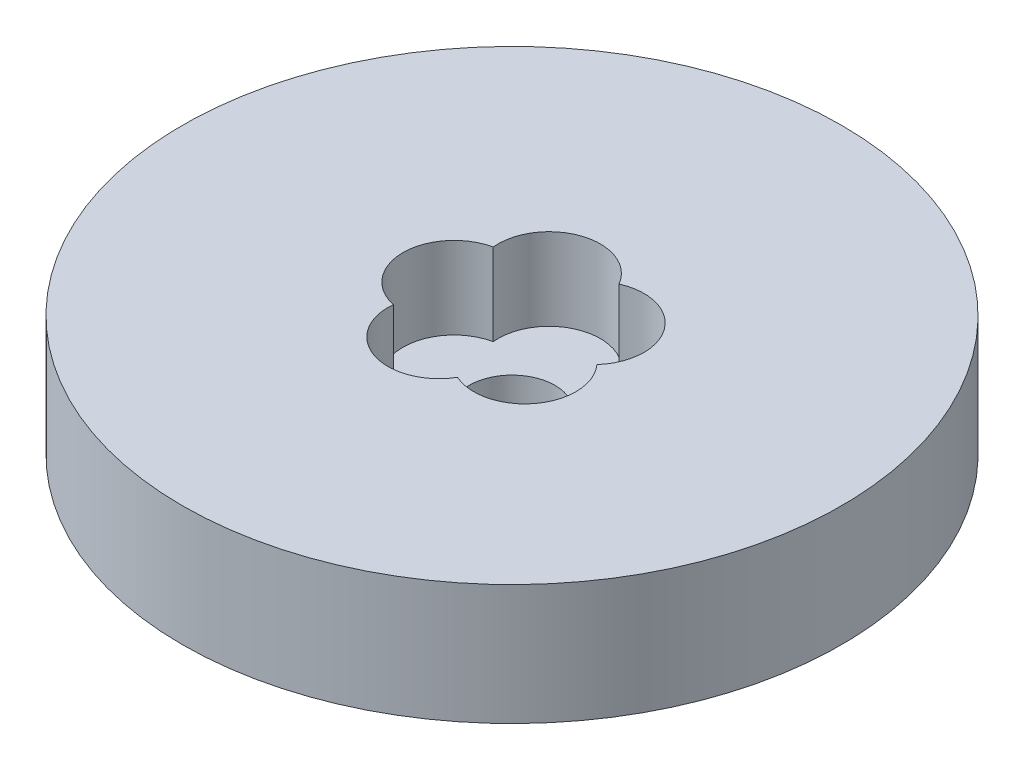
ISO-10303-21;
HEADER;
FILE_DESCRIPTION(('STEP AP214'),'2;1');
FILE_NAME('part.step','',(''),(''),'','','');
FILE_SCHEMA(('AUTOMOTIVE_DESIGN { 1 0 10303 214 1 1 1 1 }'));
ENDSEC;
DATA;
#1=APPLICATION_CONTEXT('core data for automotive mechanical design processes');
#2=APPLICATION_PROTOCOL_DEFINITION('international standard','automotive_design',2000,#1);
#3=PRODUCT_CONTEXT('',#1,'mechanical');
#4=PRODUCT('Part','Part','',(#3));
#5=PRODUCT_RELATED_PRODUCT_CATEGORY('part','',(#4));
#6=PRODUCT_DEFINITION_FORMATION('','',#4);
#7=PRODUCT_DEFINITION_CONTEXT('part definition',#1,'design');
#8=PRODUCT_DEFINITION('design','',#6,#7);
#9=PRODUCT_DEFINITION_SHAPE('','',#8);
#10=(LENGTH_UNIT() NAMED_UNIT(*) SI_UNIT(.MILLI.,.METRE.));
#11=(NAMED_UNIT(*) PLANE_ANGLE_UNIT() SI_UNIT($,.RADIAN.));
#12=(NAMED_UNIT(*) SI_UNIT($,.STERADIAN.) SOLID_ANGLE_UNIT());
#13=UNCERTAINTY_MEASURE_WITH_UNIT(LENGTH_MEASURE(1.E-05),#10,'distance_accuracy_value','');
#14=(GEOMETRIC_REPRESENTATION_CONTEXT(3) GLOBAL_UNCERTAINTY_ASSIGNED_CONTEXT((#13)) GLOBAL_UNIT_ASSIGNED_CONTEXT((#10,
#11,#12)) REPRESENTATION_CONTEXT('',''));
#15=CARTESIAN_POINT('',(0.,0.,0.));
#16=DIRECTION('',(0.,0.,1.));
#17=DIRECTION('',(1.,0.,0.));
#18=AXIS2_PLACEMENT_3D('',#15,#16,#17);
#19=CARTESIAN_POINT('',(0.,21.,0.));
#20=DIRECTION('',(0.,-1.,0.));
#21=DIRECTION('',(0.,0.,-1.));
#22=AXIS2_PLACEMENT_3D('',#19,#20,#21);
#23=CYLINDRICAL_SURFACE('',#22,7.5);
#24=CARTESIAN_POINT('',(0.,0.,0.));
#25=DIRECTION('',(0.,1.,0.));
#26=DIRECTION('',(0.,0.,1.));
#27=AXIS2_PLACEMENT_3D('',#24,#25,#26);
#28=CIRCLE('',#27,7.5);
#29=CARTESIAN_POINT('',(0.,0.,-7.5));
#30=VERTEX_POINT('',#29);
#31=EDGE_CURVE('E129',#30,#30,#28,.T.);
#32=CARTESIAN_POINT('',(0.,6.69996960669796,0.));
#33=DIRECTION('',(0.,1.,0.));
#34=DIRECTION('',(0.,0.,1.));
#35=AXIS2_PLACEMENT_3D('',#32,#33,#34);
#36=CIRCLE('',#35,7.5);
#37=CARTESIAN_POINT('',(0.,6.69996960669796,-7.5));
#38=VERTEX_POINT('',#37);
#39=EDGE_CURVE('E11',#38,#38,#36,.T.);
#40=CARTESIAN_POINT('',(0.,0.,-7.5));
#41=CARTESIAN_POINT('',(0.,0.0697913500697702,-7.5));
#42=CARTESIAN_POINT('',(0.,0.13958270013954,-7.5));
#43=CARTESIAN_POINT('',(0.,0.279165400279081,-7.5));
#44=CARTESIAN_POINT('',(0.,0.348956750348851,-7.5));
#45=CARTESIAN_POINT('',(0.,0.488539450488393,-7.5));
#46=CARTESIAN_POINT('',(0.,0.558330800558164,-7.5));
#47=CARTESIAN_POINT('',(0.,0.697913500697706,-7.5));
#48=CARTESIAN_POINT('',(0.,0.767704850767476,-7.5));
#49=CARTESIAN_POINT('',(0.,0.907287550907016,-7.5));
#50=CARTESIAN_POINT('',(0.,0.977078900976787,-7.5));
#51=CARTESIAN_POINT('',(0.,1.11666160111633,-7.5));
#52=CARTESIAN_POINT('',(0.,1.1864529511861,-7.5));
#53=CARTESIAN_POINT('',(0.,1.32603565132564,-7.5));
#54=CARTESIAN_POINT('',(0.,1.39582700139541,-7.5));
#55=CARTESIAN_POINT('',(0.,1.53540970153495,-7.5));
#56=CARTESIAN_POINT('',(0.,1.60520105160472,-7.5));
#57=CARTESIAN_POINT('',(0.,1.74478375174426,-7.5));
#58=CARTESIAN_POINT('',(0.,1.81457510181403,-7.5));
#59=CARTESIAN_POINT('',(0.,1.95415780195357,-7.5));
#60=CARTESIAN_POINT('',(0.,2.02394915202334,-7.5));
#61=CARTESIAN_POINT('',(0.,2.16353185216288,-7.5));
#62=CARTESIAN_POINT('',(0.,2.23332320223265,-7.5));
#63=CARTESIAN_POINT('',(0.,2.3729059023722,-7.5));
#64=CARTESIAN_POINT('',(0.,2.44269725244197,-7.5));
#65=CARTESIAN_POINT('',(0.,2.58227995258151,-7.5));
#66=CARTESIAN_POINT('',(0.,2.65207130265128,-7.5));
#67=CARTESIAN_POINT('',(0.,2.79165400279082,-7.5));
#68=CARTESIAN_POINT('',(0.,2.86144535286059,-7.5));
#69=CARTESIAN_POINT('',(0.,3.00102805300013,-7.5));
#70=CARTESIAN_POINT('',(0.,3.0708194030699,-7.5));
#71=CARTESIAN_POINT('',(0.,3.21040210320944,-7.5));
#72=CARTESIAN_POINT('',(0.,3.28019345327921,-7.5));
#73=CARTESIAN_POINT('',(0.,3.41977615341875,-7.5));
#74=CARTESIAN_POINT('',(0.,3.48956750348853,-7.5));
#75=CARTESIAN_POINT('',(0.,3.62915020362807,-7.5));
#76=CARTESIAN_POINT('',(0.,3.69894155369784,-7.5));
#77=CARTESIAN_POINT('',(0.,3.83852425383738,-7.5));
#78=CARTESIAN_POINT('',(0.,3.90831560390715,-7.5));
#79=CARTESIAN_POINT('',(0.,4.04789830404669,-7.5));
#80=CARTESIAN_POINT('',(0.,4.11768965411646,-7.5));
#81=CARTESIAN_POINT('',(0.,4.257272354256,-7.5));
#82=CARTESIAN_POINT('',(0.,4.32706370432577,-7.5));
#83=CARTESIAN_POINT('',(0.,4.46664640446531,-7.5));
#84=CARTESIAN_POINT('',(0.,4.53643775453508,-7.5));
#85=CARTESIAN_POINT('',(0.,4.67602045467462,-7.5));
#86=CARTESIAN_POINT('',(0.,4.74581180474439,-7.5));
#87=CARTESIAN_POINT('',(0.,4.88539450488393,-7.5));
#88=CARTESIAN_POINT('',(0.,4.9551858549537,-7.5));
#89=CARTESIAN_POINT('',(0.,5.09476855509324,-7.5));
#90=CARTESIAN_POINT('',(0.,5.16455990516301,-7.5));
#91=CARTESIAN_POINT('',(0.,5.30414260530256,-7.5));
#92=CARTESIAN_POINT('',(0.,5.37393395537233,-7.5));
#93=CARTESIAN_POINT('',(0.,5.51351665551187,-7.5));
#94=CARTESIAN_POINT('',(0.,5.58330800558164,-7.5));
#95=CARTESIAN_POINT('',(0.,5.72289070572118,-7.5));
#96=CARTESIAN_POINT('',(0.,5.79268205579095,-7.5));
#97=CARTESIAN_POINT('',(0.,5.93226475593049,-7.5));
#98=CARTESIAN_POINT('',(0.,6.00205610600026,-7.5));
#99=CARTESIAN_POINT('',(0.,6.1416388061398,-7.5));
#100=CARTESIAN_POINT('',(0.,6.21143015620957,-7.5));
#101=CARTESIAN_POINT('',(0.,6.35101285634911,-7.5));
#102=CARTESIAN_POINT('',(0.,6.42080420641888,-7.5));
#103=CARTESIAN_POINT('',(0.,6.56038690655842,-7.5));
#104=CARTESIAN_POINT('',(0.,6.63017825662819,-7.5));
#105=CARTESIAN_POINT('',(0.,6.69996960669796,-7.5));
#106=B_SPLINE_CURVE_WITH_KNOTS('',3,(#40,#41,#42,#43,#44,#45,#46,#47,#48,#49,#50,#51,#52,#53,
#54,#55,#56,#57,#58,#59,#60,#61,#62,#63,#64,#65,#66,#67,#68,#69,#70,#71,#72,#73,#74,#75,#76,#77,
#78,#79,#80,#81,#82,#83,#84,#85,#86,#87,#88,#89,#90,#91,#92,#93,#94,#95,#96,#97,#98,#99,#100,
#101,#102,#103,#104,#105),.UNSPECIFIED.,.F.,.F.,(4,2,2,2,2,2,2,2,2,2,2,2,2,2,2,2,2,2,2,2,2,2,2,
2,2,2,2,2,2,2,2,2,4),(0.,0.209374050209311,0.418748100418621,0.628122150627936,
0.837496200837246,1.04687025104656,1.25624430125587,1.46561835146518,1.67499240167449,
1.8843664518838,2.09374050209311,2.30311455230242,2.51248860251174,2.72186265272105,
2.93123670293036,3.14061075313967,3.34998480334898,3.5593588535583,3.76873290376761,
3.97810695397692,4.18748100418623,4.39685505439554,4.60622910460485,4.81560315481416,
5.02497720502347,5.23435125523278,5.4437253054421,5.65309935565141,5.86247340586072,
6.07184745607003,6.28122150627934,6.49059555648865,6.69996960669796),.UNSPECIFIED.);
#107=EDGE_CURVE('BSEAM39',#30,#38,#106,.T.);
#108=ORIENTED_EDGE('',*,*,#31,.F.);
#109=ORIENTED_EDGE('',*,*,#39,.T.);
#110=ORIENTED_EDGE('',*,*,#107,.T.);
#111=ORIENTED_EDGE('',*,*,#107,.F.);
#112=EDGE_LOOP('',(#108,#110,#109,#111));
#113=FACE_BOUND('',#112,.T.);
#114=ADVANCED_FACE('F39',(#113),#23,.F.);
#115=CARTESIAN_POINT('',(0.,21.,0.));
#116=DIRECTION('',(0.,-1.,0.));
#117=DIRECTION('',(0.,0.,-1.));
#118=AXIS2_PLACEMENT_3D('',#115,#116,#117);
#119=CYLINDRICAL_SURFACE('',#118,57.5);
#120=CARTESIAN_POINT('',(0.,21.,0.));
#121=DIRECTION('',(0.,1.,0.));
#122=DIRECTION('',(0.,0.,1.));
#123=AXIS2_PLACEMENT_3D('',#120,#121,#122);
#124=CIRCLE('',#123,57.5);
#125=CARTESIAN_POINT('',(0.,21.,-57.5));
#126=VERTEX_POINT('',#125);
#127=EDGE_CURVE('E50',#126,#126,#124,.T.);
#128=CARTESIAN_POINT('',(0.,0.,0.));
#129=DIRECTION('',(0.,1.,0.));
#130=DIRECTION('',(0.,0.,1.));
#131=AXIS2_PLACEMENT_3D('',#128,#129,#130);
#132=CIRCLE('',#131,57.5);
#133=CARTESIAN_POINT('',(0.,0.,-57.5));
#134=VERTEX_POINT('',#133);
#135=EDGE_CURVE('E133',#134,#134,#132,.T.);
#136=CARTESIAN_POINT('',(0.,21.,-57.5));
#137=CARTESIAN_POINT('',(0.,20.78125,-57.5));
#138=CARTESIAN_POINT('',(0.,20.5625,-57.5));
#139=CARTESIAN_POINT('',(0.,20.125,-57.5));
#140=CARTESIAN_POINT('',(0.,19.90625,-57.5));
#141=CARTESIAN_POINT('',(0.,19.46875,-57.5));
#142=CARTESIAN_POINT('',(0.,19.25,-57.5));
#143=CARTESIAN_POINT('',(0.,18.8125,-57.5));
#144=CARTESIAN_POINT('',(0.,18.59375,-57.5));
#145=CARTESIAN_POINT('',(0.,18.15625,-57.5));
#146=CARTESIAN_POINT('',(0.,17.9375,-57.5));
#147=CARTESIAN_POINT('',(0.,17.5,-57.5));
#148=CARTESIAN_POINT('',(0.,17.28125,-57.5));
#149=CARTESIAN_POINT('',(0.,16.84375,-57.5));
#150=CARTESIAN_POINT('',(0.,16.625,-57.5));
#151=CARTESIAN_POINT('',(0.,16.1875,-57.5));
#152=CARTESIAN_POINT('',(0.,15.96875,-57.5));
#153=CARTESIAN_POINT('',(0.,15.53125,-57.5));
#154=CARTESIAN_POINT('',(0.,15.3125,-57.5));
#155=CARTESIAN_POINT('',(0.,14.875,-57.5));
#156=CARTESIAN_POINT('',(0.,14.65625,-57.5));
#157=CARTESIAN_POINT('',(0.,14.21875,-57.5));
#158=CARTESIAN_POINT('',(0.,14.,-57.5));
#159=CARTESIAN_POINT('',(0.,13.5625,-57.5));
#160=CARTESIAN_POINT('',(0.,13.34375,-57.5));
#161=CARTESIAN_POINT('',(0.,12.90625,-57.5));
#162=CARTESIAN_POINT('',(0.,12.6875,-57.5));
#163=CARTESIAN_POINT('',(0.,12.25,-57.5));
#164=CARTESIAN_POINT('',(0.,12.03125,-57.5));
#165=CARTESIAN_POINT('',(0.,11.59375,-57.5));
#166=CARTESIAN_POINT('',(0.,11.375,-57.5));
#167=CARTESIAN_POINT('',(0.,10.9375,-57.5));
#168=CARTESIAN_POINT('',(0.,10.71875,-57.5));
#169=CARTESIAN_POINT('',(0.,10.28125,-57.5));
#170=CARTESIAN_POINT('',(0.,10.0625,-57.5));
#171=CARTESIAN_POINT('',(0.,9.625,-57.5));
#172=CARTESIAN_POINT('',(0.,9.40625,-57.5));
#173=CARTESIAN_POINT('',(0.,8.96875,-57.5));
#174=CARTESIAN_POINT('',(0.,8.75,-57.5));
#175=CARTESIAN_POINT('',(0.,8.3125,-57.5));
#176=CARTESIAN_POINT('',(0.,8.09375,-57.5));
#177=CARTESIAN_POINT('',(0.,7.65625,-57.5));
#178=CARTESIAN_POINT('',(0.,7.4375,-57.5));
#179=CARTESIAN_POINT('',(0.,7.,-57.5));
#180=CARTESIAN_POINT('',(0.,6.78125,-57.5));
#181=CARTESIAN_POINT('',(0.,6.34375,-57.5));
#182=CARTESIAN_POINT('',(0.,6.125,-57.5));
#183=CARTESIAN_POINT('',(0.,5.6875,-57.5));
#184=CARTESIAN_POINT('',(0.,5.46875,-57.5));
#185=CARTESIAN_POINT('',(0.,5.03125,-57.5));
#186=CARTESIAN_POINT('',(0.,4.8125,-57.5));
#187=CARTESIAN_POINT('',(0.,4.375,-57.5));
#188=CARTESIAN_POINT('',(0.,4.15625,-57.5));
#189=CARTESIAN_POINT('',(0.,3.71875,-57.5));
#190=CARTESIAN_POINT('',(0.,3.5,-57.5));
#191=CARTESIAN_POINT('',(0.,3.0625,-57.5));
#192=CARTESIAN_POINT('',(0.,2.84375,-57.5));
#193=CARTESIAN_POINT('',(0.,2.40625,-57.5));
#194=CARTESIAN_POINT('',(0.,2.1875,-57.5));
#195=CARTESIAN_POINT('',(0.,1.75,-57.5));
#196=CARTESIAN_POINT('',(0.,1.53125,-57.5));
#197=CARTESIAN_POINT('',(0.,1.09375,-57.5));
#198=CARTESIAN_POINT('',(0.,0.875000000000001,-57.5));
#199=CARTESIAN_POINT('',(0.,0.4375,-57.5));
#200=CARTESIAN_POINT('',(0.,0.21875,-57.5));
#201=CARTESIAN_POINT('',(0.,0.,-57.5));
#202=B_SPLINE_CURVE_WITH_KNOTS('',3,(#136,#137,#138,#139,#140,#141,#142,#143,#144,#145,#146,
#147,#148,#149,#150,#151,#152,#153,#154,#155,#156,#157,#158,#159,#160,#161,#162,#163,#164,#165,
#166,#167,#168,#169,#170,#171,#172,#173,#174,#175,#176,#177,#178,#179,#180,#181,#182,#183,#184,
#185,#186,#187,#188,#189,#190,#191,#192,#193,#194,#195,#196,#197,#198,#199,#200,#201),
.UNSPECIFIED.,.F.,.F.,(4,2,2,2,2,2,2,2,2,2,2,2,2,2,2,2,2,2,2,2,2,2,2,2,2,2,2,2,2,2,2,2,4),(0.,
0.656250000000001,1.3125,1.96875,2.625,3.28125,3.9375,4.59375,5.25,5.90625,6.5625,7.21875,7.875,
8.53125,9.1875,9.84375,10.5,11.15625,11.8125,12.46875,13.125,13.78125,14.4375,15.09375,15.75,
16.40625,17.0625,17.71875,18.375,19.03125,19.6875,20.34375,21.),.UNSPECIFIED.);
#203=EDGE_CURVE('BSEAM41',#126,#134,#202,.T.);
#204=ORIENTED_EDGE('',*,*,#127,.F.);
#205=ORIENTED_EDGE('',*,*,#135,.T.);
#206=ORIENTED_EDGE('',*,*,#203,.T.);
#207=ORIENTED_EDGE('',*,*,#203,.F.);
#208=EDGE_LOOP('',(#204,#206,#205,#207));
#209=FACE_BOUND('',#208,.T.);
#210=ADVANCED_FACE('F41',(#209),#119,.T.);
#211=CARTESIAN_POINT('',(0.,21.,0.));
#212=DIRECTION('',(0.,1.,0.));
#213=DIRECTION('',(0.,0.,1.));
#214=AXIS2_PLACEMENT_3D('',#211,#212,#213);
#215=PLANE('',#214);
#216=CARTESIAN_POINT('',(-3.12386026699774,21.,9.61425331617492));
#217=DIRECTION('',(0.,1.,0.));
#218=DIRECTION('',(0.951056516295155,0.,0.309016994374945));
#219=AXIS2_PLACEMENT_3D('',#216,#217,#218);
#220=CIRCLE('',#219,8.91402800557836);
#221=CARTESIAN_POINT('',(-11.9921942566491,21.,8.71283913155722));
#222=VERTEX_POINT('',#221);
#223=CARTESIAN_POINT('',(4.58061060634873,21.,14.0976698533696));
#224=VERTEX_POINT('',#223);
#225=EDGE_CURVE('E119',#222,#224,#220,.T.);
#226=ORIENTED_EDGE('',*,*,#225,.F.);
#227=CARTESIAN_POINT('',(-10.1090241762154,21.,0.));
#228=DIRECTION('',(0.,1.,0.));
#229=DIRECTION('',(0.,0.,1.));
#230=AXIS2_PLACEMENT_3D('',#227,#228,#229);
#231=CIRCLE('',#230,8.91402800557836);
#232=CARTESIAN_POINT('',(-11.9921942566492,21.,-8.71283913155719));
#233=VERTEX_POINT('',#232);
#234=EDGE_CURVE('E127',#233,#222,#231,.T.);
#235=ORIENTED_EDGE('',*,*,#234,.F.);
#236=CARTESIAN_POINT('',(-3.12386026699787,21.,-9.61425331617487));
#237=DIRECTION('',(0.,1.,0.));
#238=DIRECTION('',(-0.95105651629515,0.,0.309016994374958));
#239=AXIS2_PLACEMENT_3D('',#236,#237,#238);
#240=CIRCLE('',#239,8.91402800557836);
#241=CARTESIAN_POINT('',(4.58061060634853,21.,-14.0976698533697));
#242=VERTEX_POINT('',#241);
#243=EDGE_CURVE('E53',#242,#233,#240,.T.);
#244=ORIENTED_EDGE('',*,*,#243,.F.);
#245=CARTESIAN_POINT('',(8.17837235510541,21.,-5.94193532584755));
#246=DIRECTION('',(0.,1.,0.));
#247=DIRECTION('',(-0.58778525229248,0.,-0.809016994374942));
#248=AXIS2_PLACEMENT_3D('',#245,#246,#247);
#249=CIRCLE('',#248,8.91402800557836);
#250=CARTESIAN_POINT('',(14.8231673006008,21.,-1.06685493772574E-13));
#251=VERTEX_POINT('',#250);
#252=EDGE_CURVE('E99',#251,#242,#249,.T.);
#253=ORIENTED_EDGE('',*,*,#252,.F.);
#254=CARTESIAN_POINT('',(8.1783723551055,21.,5.94193532584744));
#255=DIRECTION('',(0.,1.,0.));
#256=DIRECTION('',(0.587785252292469,0.,-0.809016994374951));
#257=AXIS2_PLACEMENT_3D('',#254,#255,#256);
#258=CIRCLE('',#257,8.91402800557836);
#259=EDGE_CURVE('E113',#224,#251,#258,.T.);
#260=ORIENTED_EDGE('',*,*,#259,.F.);
#261=EDGE_LOOP('',(#226,#235,#244,#253,#260));
#262=FACE_BOUND('',#261,.T.);
#263=ORIENTED_EDGE('',*,*,#127,.T.);
#264=EDGE_LOOP('',(#263));
#265=FACE_BOUND('',#264,.T.);
#266=ADVANCED_FACE('F141',(#262,#265),#215,.T.);
#267=CARTESIAN_POINT('',(0.,0.,0.));
#268=DIRECTION('',(0.,1.,0.));
#269=DIRECTION('',(0.,0.,1.));
#270=AXIS2_PLACEMENT_3D('',#267,#268,#269);
#271=PLANE('',#270);
#272=ORIENTED_EDGE('',*,*,#31,.T.);
#273=EDGE_LOOP('',(#272));
#274=FACE_BOUND('',#273,.T.);
#275=ORIENTED_EDGE('',*,*,#135,.F.);
#276=EDGE_LOOP('',(#275));
#277=FACE_BOUND('',#276,.T.);
#278=ADVANCED_FACE('F139',(#274,#277),#271,.F.);
#279=CARTESIAN_POINT('',(-10.1090241762154,6.69996960669796,0.));
#280=DIRECTION('',(0.,1.,0.));
#281=DIRECTION('',(0.,0.,1.));
#282=AXIS2_PLACEMENT_3D('',#279,#280,#281);
#283=CYLINDRICAL_SURFACE('',#282,8.91402800557836);
#284=ORIENTED_EDGE('',*,*,#234,.T.);
#285=DIRECTION('',(0.,1.,0.));
#286=VECTOR('',#285,1.);
#287=CARTESIAN_POINT('',(-11.9921942566491,13.849984803349,8.71283913155721));
#288=LINE('',#287,#286);
#289=CARTESIAN_POINT('',(-11.9921942566491,6.69996960669796,8.71283913155721));
#290=VERTEX_POINT('',#289);
#291=EDGE_CURVE('E65',#222,#290,#288,.F.);
#292=ORIENTED_EDGE('',*,*,#291,.T.);
#293=CARTESIAN_POINT('',(-10.1090241762154,6.69996960669796,0.));
#294=DIRECTION('',(0.,1.,0.));
#295=DIRECTION('',(0.,0.,1.));
#296=AXIS2_PLACEMENT_3D('',#293,#294,#295);
#297=CIRCLE('',#296,8.91402800557836);
#298=CARTESIAN_POINT('',(-11.9921942566492,6.69996960669796,-8.71283913155719));
#299=VERTEX_POINT('',#298);
#300=EDGE_CURVE('E130',#299,#290,#297,.T.);
#301=ORIENTED_EDGE('',*,*,#300,.F.);
#302=DIRECTION('',(0.,1.,0.));
#303=VECTOR('',#302,1.);
#304=CARTESIAN_POINT('',(-11.9921942566492,13.849984803349,-8.71283913155719));
#305=LINE('',#304,#303);
#306=EDGE_CURVE('E108',#299,#233,#305,.T.);
#307=ORIENTED_EDGE('',*,*,#306,.T.);
#308=EDGE_LOOP('',(#284,#292,#301,#307));
#309=FACE_BOUND('',#308,.T.);
#310=ADVANCED_FACE('F142',(#309),#283,.F.);
#311=CARTESIAN_POINT('',(-10.1090241762154,6.69996960669796,0.));
#312=DIRECTION('',(0.,1.,0.));
#313=DIRECTION('',(0.,0.,1.));
#314=AXIS2_PLACEMENT_3D('',#311,#312,#313);
#315=PLANE('',#314);
#316=ORIENTED_EDGE('',*,*,#300,.T.);
#317=CARTESIAN_POINT('',(-3.12386026699774,6.69996960669796,9.61425331617492));
#318=DIRECTION('',(0.,1.,0.));
#319=DIRECTION('',(0.951056516295155,0.,0.309016994374945));
#320=AXIS2_PLACEMENT_3D('',#317,#318,#319);
#321=CIRCLE('',#320,8.91402800557836);
#322=CARTESIAN_POINT('',(4.58061060634873,6.69996960669796,14.0976698533696));
#323=VERTEX_POINT('',#322);
#324=EDGE_CURVE('E121',#290,#323,#321,.T.);
#325=ORIENTED_EDGE('',*,*,#324,.T.);
#326=CARTESIAN_POINT('',(8.1783723551055,6.69996960669796,5.94193532584744));
#327=DIRECTION('',(0.,1.,0.));
#328=DIRECTION('',(0.587785252292469,0.,-0.809016994374951));
#329=AXIS2_PLACEMENT_3D('',#326,#327,#328);
#330=CIRCLE('',#329,8.91402800557836);
#331=CARTESIAN_POINT('',(14.8231673006008,6.69996960669796,-1.06685493772574E-13));
#332=VERTEX_POINT('',#331);
#333=EDGE_CURVE('E92',#323,#332,#330,.T.);
#334=ORIENTED_EDGE('',*,*,#333,.T.);
#335=CARTESIAN_POINT('',(8.17837235510541,6.69996960669796,-5.94193532584755));
#336=DIRECTION('',(0.,1.,0.));
#337=DIRECTION('',(-0.58778525229248,0.,-0.809016994374942));
#338=AXIS2_PLACEMENT_3D('',#335,#336,#337);
#339=CIRCLE('',#338,8.91402800557836);
#340=CARTESIAN_POINT('',(4.58061060634853,6.69996960669796,-14.0976698533697));
#341=VERTEX_POINT('',#340);
#342=EDGE_CURVE('E88',#332,#341,#339,.T.);
#343=ORIENTED_EDGE('',*,*,#342,.T.);
#344=CARTESIAN_POINT('',(-3.12386026699787,6.69996960669796,-9.61425331617487));
#345=DIRECTION('',(0.,1.,0.));
#346=DIRECTION('',(-0.95105651629515,0.,0.309016994374958));
#347=AXIS2_PLACEMENT_3D('',#344,#345,#346);
#348=CIRCLE('',#347,8.91402800557836);
#349=EDGE_CURVE('E95',#341,#299,#348,.T.);
#350=ORIENTED_EDGE('',*,*,#349,.T.);
#351=EDGE_LOOP('',(#316,#325,#334,#343,#350));
#352=FACE_BOUND('',#351,.T.);
#353=ORIENTED_EDGE('',*,*,#39,.F.);
#354=EDGE_LOOP('',(#353));
#355=FACE_BOUND('',#354,.T.);
#356=ADVANCED_FACE('F90',(#352,#355),#315,.T.);
#357=CARTESIAN_POINT('',(-3.12386026699774,6.69996960669796,9.61425331617492));
#358=DIRECTION('',(0.,1.,0.));
#359=DIRECTION('',(0.,0.,1.));
#360=AXIS2_PLACEMENT_3D('',#357,#358,#359);
#361=CYLINDRICAL_SURFACE('',#360,8.91402800557836);
#362=ORIENTED_EDGE('',*,*,#225,.T.);
#363=DIRECTION('',(0.,1.,0.));
#364=VECTOR('',#363,1.);
#365=CARTESIAN_POINT('',(4.58061060634873,13.849984803349,14.0976698533696));
#366=LINE('',#365,#364);
#367=EDGE_CURVE('E106',#224,#323,#366,.F.);
#368=ORIENTED_EDGE('',*,*,#367,.T.);
#369=ORIENTED_EDGE('',*,*,#324,.F.);
#370=ORIENTED_EDGE('',*,*,#291,.F.);
#371=EDGE_LOOP('',(#362,#368,#369,#370));
#372=FACE_BOUND('',#371,.T.);
#373=ADVANCED_FACE('F164',(#372),#361,.F.);
#374=CARTESIAN_POINT('',(-3.12386026699787,6.69996960669796,-9.61425331617487));
#375=DIRECTION('',(0.,1.,0.));
#376=DIRECTION('',(0.,0.,1.));
#377=AXIS2_PLACEMENT_3D('',#374,#375,#376);
#378=CYLINDRICAL_SURFACE('',#377,8.91402800557836);
#379=ORIENTED_EDGE('',*,*,#349,.F.);
#380=DIRECTION('',(0.,1.,0.));
#381=VECTOR('',#380,1.);
#382=CARTESIAN_POINT('',(4.58061060634853,13.849984803349,-14.0976698533697));
#383=LINE('',#382,#381);
#384=EDGE_CURVE('E103',#242,#341,#383,.F.);
#385=ORIENTED_EDGE('',*,*,#384,.F.);
#386=ORIENTED_EDGE('',*,*,#243,.T.);
#387=ORIENTED_EDGE('',*,*,#306,.F.);
#388=EDGE_LOOP('',(#379,#385,#386,#387));
#389=FACE_BOUND('',#388,.T.);
#390=ADVANCED_FACE('F107',(#389),#378,.F.);
#391=CARTESIAN_POINT('',(8.1783723551055,6.69996960669796,5.94193532584744));
#392=DIRECTION('',(0.,1.,0.));
#393=DIRECTION('',(0.,0.,1.));
#394=AXIS2_PLACEMENT_3D('',#391,#392,#393);
#395=CYLINDRICAL_SURFACE('',#394,8.91402800557836);
#396=ORIENTED_EDGE('',*,*,#259,.T.);
#397=DIRECTION('',(0.,1.,0.));
#398=VECTOR('',#397,1.);
#399=CARTESIAN_POINT('',(14.8231673006008,13.849984803349,-1.06685493772574E-13));
#400=LINE('',#399,#398);
#401=EDGE_CURVE('E97',#251,#332,#400,.F.);
#402=ORIENTED_EDGE('',*,*,#401,.T.);
#403=ORIENTED_EDGE('',*,*,#333,.F.);
#404=ORIENTED_EDGE('',*,*,#367,.F.);
#405=EDGE_LOOP('',(#396,#402,#403,#404));
#406=FACE_BOUND('',#405,.T.);
#407=ADVANCED_FACE('F169',(#406),#395,.F.);
#408=CARTESIAN_POINT('',(8.17837235510541,6.69996960669796,-5.94193532584755));
#409=DIRECTION('',(0.,1.,0.));
#410=DIRECTION('',(0.,0.,1.));
#411=AXIS2_PLACEMENT_3D('',#408,#409,#410);
#412=CYLINDRICAL_SURFACE('',#411,8.91402800557836);
#413=ORIENTED_EDGE('',*,*,#384,.T.);
#414=ORIENTED_EDGE('',*,*,#342,.F.);
#415=ORIENTED_EDGE('',*,*,#401,.F.);
#416=ORIENTED_EDGE('',*,*,#252,.T.);
#417=EDGE_LOOP('',(#413,#414,#415,#416));
#418=FACE_BOUND('',#417,.T.);
#419=ADVANCED_FACE('F102',(#418),#412,.F.);
#420=CLOSED_SHELL('',(#114,#210,#266,#278,#310,#356,#373,#390,#407,#419));
#421=MANIFOLD_SOLID_BREP('B2',#420);
#422=ADVANCED_BREP_SHAPE_REPRESENTATION('',(#18,#421),#14);
#423=SHAPE_DEFINITION_REPRESENTATION(#9,#422);
ENDSEC;
END-ISO-10303-21;
